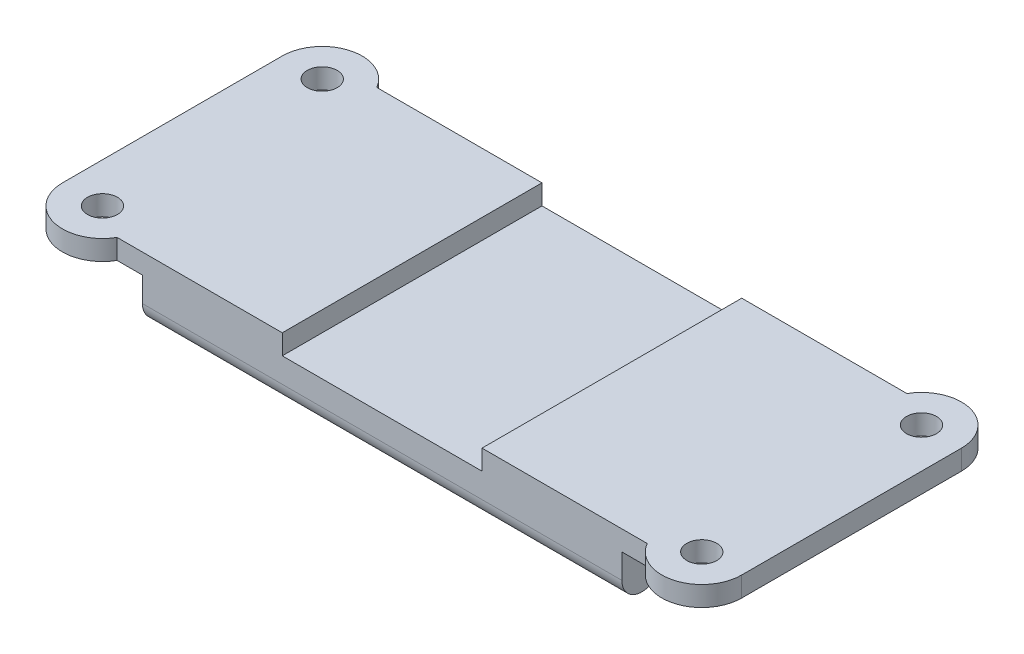
ISO-10303-21;
HEADER;
FILE_DESCRIPTION(('STEP AP214'),'2;1');
FILE_NAME('part.step','',(''),(''),'','','');
FILE_SCHEMA(('AUTOMOTIVE_DESIGN { 1 0 10303 214 1 1 1 1 }'));
ENDSEC;
DATA;
#1=APPLICATION_CONTEXT('core data for automotive mechanical design processes');
#2=APPLICATION_PROTOCOL_DEFINITION('international standard','automotive_design',2000,#1);
#3=PRODUCT_CONTEXT('',#1,'mechanical');
#4=PRODUCT('Part','Part','',(#3));
#5=PRODUCT_RELATED_PRODUCT_CATEGORY('part','',(#4));
#6=PRODUCT_DEFINITION_FORMATION('','',#4);
#7=PRODUCT_DEFINITION_CONTEXT('part definition',#1,'design');
#8=PRODUCT_DEFINITION('design','',#6,#7);
#9=PRODUCT_DEFINITION_SHAPE('','',#8);
#10=(LENGTH_UNIT() NAMED_UNIT(*) SI_UNIT(.MILLI.,.METRE.));
#11=(NAMED_UNIT(*) PLANE_ANGLE_UNIT() SI_UNIT($,.RADIAN.));
#12=(NAMED_UNIT(*) SI_UNIT($,.STERADIAN.) SOLID_ANGLE_UNIT());
#13=UNCERTAINTY_MEASURE_WITH_UNIT(LENGTH_MEASURE(1.E-05),#10,'distance_accuracy_value','');
#14=(GEOMETRIC_REPRESENTATION_CONTEXT(3) GLOBAL_UNCERTAINTY_ASSIGNED_CONTEXT((#13)) GLOBAL_UNIT_ASSIGNED_CONTEXT((#10,
#11,#12)) REPRESENTATION_CONTEXT('',''));
#15=CARTESIAN_POINT('',(0.,0.,0.));
#16=DIRECTION('',(0.,0.,1.));
#17=DIRECTION('',(1.,0.,0.));
#18=AXIS2_PLACEMENT_3D('',#15,#16,#17);
#19=CARTESIAN_POINT('',(24.,-8.,13.));
#20=DIRECTION('',(0.,0.,1.));
#21=DIRECTION('',(1.,0.,0.));
#22=AXIS2_PLACEMENT_3D('',#19,#20,#21);
#23=PLANE('',#22);
#24=DIRECTION('',(-1.,0.,0.));
#25=VECTOR('',#24,1.);
#26=CARTESIAN_POINT('',(34.,-2.,13.));
#27=LINE('',#26,#25);
#28=CARTESIAN_POINT('',(26.5358983848622,-2.,13.));
#29=VERTEX_POINT('',#28);
#30=CARTESIAN_POINT('',(24.,-2.,13.));
#31=VERTEX_POINT('',#30);
#32=EDGE_CURVE('E199',#29,#31,#27,.T.);
#33=ORIENTED_EDGE('',*,*,#32,.F.);
#34=DIRECTION('',(0.,1.,0.));
#35=VECTOR('',#34,1.);
#36=CARTESIAN_POINT('',(26.5358983848622,-2.,13.));
#37=LINE('',#36,#35);
#38=CARTESIAN_POINT('',(26.5358983848622,0.,13.));
#39=VERTEX_POINT('',#38);
#40=EDGE_CURVE('E186',#29,#39,#37,.T.);
#41=ORIENTED_EDGE('',*,*,#40,.T.);
#42=DIRECTION('',(1.,0.,0.));
#43=VECTOR('',#42,1.);
#44=CARTESIAN_POINT('',(24.,0.,13.));
#45=LINE('',#44,#43);
#46=CARTESIAN_POINT('',(10.,0.,13.));
#47=VERTEX_POINT('',#46);
#48=EDGE_CURVE('E197',#47,#39,#45,.T.);
#49=ORIENTED_EDGE('',*,*,#48,.F.);
#50=DIRECTION('',(0.,-1.,0.));
#51=VECTOR('',#50,1.);
#52=CARTESIAN_POINT('',(10.,0.,13.));
#53=LINE('',#52,#51);
#54=CARTESIAN_POINT('',(10.,-2.,13.));
#55=VERTEX_POINT('',#54);
#56=EDGE_CURVE('E410',#47,#55,#53,.T.);
#57=ORIENTED_EDGE('',*,*,#56,.T.);
#58=DIRECTION('',(1.,0.,0.));
#59=VECTOR('',#58,1.);
#60=CARTESIAN_POINT('',(0.,-2.,13.));
#61=LINE('',#60,#59);
#62=CARTESIAN_POINT('',(-10.,-2.,13.));
#63=VERTEX_POINT('',#62);
#64=EDGE_CURVE('E418',#63,#55,#61,.T.);
#65=ORIENTED_EDGE('',*,*,#64,.F.);
#66=DIRECTION('',(0.,-1.,0.));
#67=VECTOR('',#66,1.);
#68=CARTESIAN_POINT('',(-10.,0.,13.));
#69=LINE('',#68,#67);
#70=CARTESIAN_POINT('',(-10.,0.,13.));
#71=VERTEX_POINT('',#70);
#72=EDGE_CURVE('E405',#71,#63,#69,.T.);
#73=ORIENTED_EDGE('',*,*,#72,.F.);
#74=CARTESIAN_POINT('',(-26.5358983848622,0.,13.));
#75=VERTEX_POINT('',#74);
#76=EDGE_CURVE('E207',#75,#71,#45,.T.);
#77=ORIENTED_EDGE('',*,*,#76,.F.);
#78=DIRECTION('',(0.,1.,0.));
#79=VECTOR('',#78,1.);
#80=CARTESIAN_POINT('',(-26.5358983848622,-2.,13.));
#81=LINE('',#80,#79);
#82=CARTESIAN_POINT('',(-26.5358983848622,-2.,13.));
#83=VERTEX_POINT('',#82);
#84=EDGE_CURVE('E356',#83,#75,#81,.T.);
#85=ORIENTED_EDGE('',*,*,#84,.F.);
#86=DIRECTION('',(1.,0.,0.));
#87=VECTOR('',#86,1.);
#88=CARTESIAN_POINT('',(-34.,-2.,13.));
#89=LINE('',#88,#87);
#90=CARTESIAN_POINT('',(-24.,-2.,13.));
#91=VERTEX_POINT('',#90);
#92=EDGE_CURVE('E300',#83,#91,#89,.T.);
#93=ORIENTED_EDGE('',*,*,#92,.T.);
#94=DIRECTION('',(0.,1.,0.));
#95=VECTOR('',#94,1.);
#96=CARTESIAN_POINT('',(-24.,-8.,13.));
#97=LINE('',#96,#95);
#98=CARTESIAN_POINT('',(-24.,-4.46761924206189,13.));
#99=VERTEX_POINT('',#98);
#100=EDGE_CURVE('E218',#99,#91,#97,.T.);
#101=ORIENTED_EDGE('',*,*,#100,.F.);
#102=DIRECTION('',(1.,0.,0.));
#103=VECTOR('',#102,1.);
#104=CARTESIAN_POINT('',(24.,-4.46761924206188,13.));
#105=LINE('',#104,#103);
#106=CARTESIAN_POINT('',(24.,-4.46761924206188,13.));
#107=VERTEX_POINT('',#106);
#108=EDGE_CURVE('E257',#99,#107,#105,.T.);
#109=ORIENTED_EDGE('',*,*,#108,.T.);
#110=DIRECTION('',(0.,1.,0.));
#111=VECTOR('',#110,1.);
#112=CARTESIAN_POINT('',(24.,-8.,13.));
#113=LINE('',#112,#111);
#114=EDGE_CURVE('E226',#107,#31,#113,.T.);
#115=ORIENTED_EDGE('',*,*,#114,.T.);
#116=EDGE_LOOP('',(#33,#41,#49,#57,#65,#73,#77,#85,#93,#101,#109,#115));
#117=FACE_BOUND('',#116,.T.);
#118=ADVANCED_FACE('F35',(#117),#23,.T.);
#119=CARTESIAN_POINT('',(24.,-8.,-13.));
#120=DIRECTION('',(0.,0.,-1.));
#121=DIRECTION('',(-1.,0.,0.));
#122=AXIS2_PLACEMENT_3D('',#119,#120,#121);
#123=PLANE('',#122);
#124=DIRECTION('',(-1.,0.,0.));
#125=VECTOR('',#124,1.);
#126=CARTESIAN_POINT('',(24.,0.,-13.));
#127=LINE('',#126,#125);
#128=CARTESIAN_POINT('',(26.5358983848623,0.,-13.));
#129=VERTEX_POINT('',#128);
#130=CARTESIAN_POINT('',(10.,0.,-13.));
#131=VERTEX_POINT('',#130);
#132=EDGE_CURVE('E216',#129,#131,#127,.T.);
#133=ORIENTED_EDGE('',*,*,#132,.F.);
#134=DIRECTION('',(0.,1.,0.));
#135=VECTOR('',#134,1.);
#136=CARTESIAN_POINT('',(26.5358983848623,-2.,-13.));
#137=LINE('',#136,#135);
#138=CARTESIAN_POINT('',(26.5358983848622,-2.,-13.));
#139=VERTEX_POINT('',#138);
#140=EDGE_CURVE('E393',#129,#139,#137,.F.);
#141=ORIENTED_EDGE('',*,*,#140,.T.);
#142=DIRECTION('',(-1.,0.,0.));
#143=VECTOR('',#142,1.);
#144=CARTESIAN_POINT('',(34.,-2.,-13.));
#145=LINE('',#144,#143);
#146=CARTESIAN_POINT('',(24.,-2.,-13.));
#147=VERTEX_POINT('',#146);
#148=EDGE_CURVE('E383',#139,#147,#145,.T.);
#149=ORIENTED_EDGE('',*,*,#148,.T.);
#150=DIRECTION('',(0.,1.,0.));
#151=VECTOR('',#150,1.);
#152=CARTESIAN_POINT('',(24.,-8.,-13.));
#153=LINE('',#152,#151);
#154=CARTESIAN_POINT('',(24.,-4.46761924206188,-13.));
#155=VERTEX_POINT('',#154);
#156=EDGE_CURVE('E223',#155,#147,#153,.T.);
#157=ORIENTED_EDGE('',*,*,#156,.F.);
#158=DIRECTION('',(-1.,0.,0.));
#159=VECTOR('',#158,1.);
#160=CARTESIAN_POINT('',(-24.,-4.46761924206188,-13.));
#161=LINE('',#160,#159);
#162=CARTESIAN_POINT('',(-24.,-4.46761924206188,-13.));
#163=VERTEX_POINT('',#162);
#164=EDGE_CURVE('E246',#155,#163,#161,.T.);
#165=ORIENTED_EDGE('',*,*,#164,.T.);
#166=DIRECTION('',(0.,1.,0.));
#167=VECTOR('',#166,1.);
#168=CARTESIAN_POINT('',(-24.,-8.,-13.));
#169=LINE('',#168,#167);
#170=CARTESIAN_POINT('',(-24.,-2.,-13.));
#171=VERTEX_POINT('',#170);
#172=EDGE_CURVE('E219',#163,#171,#169,.T.);
#173=ORIENTED_EDGE('',*,*,#172,.T.);
#174=DIRECTION('',(1.,0.,0.));
#175=VECTOR('',#174,1.);
#176=CARTESIAN_POINT('',(-34.,-2.,-13.));
#177=LINE('',#176,#175);
#178=CARTESIAN_POINT('',(-26.5358983848622,-2.,-13.));
#179=VERTEX_POINT('',#178);
#180=EDGE_CURVE('E302',#179,#171,#177,.T.);
#181=ORIENTED_EDGE('',*,*,#180,.F.);
#182=DIRECTION('',(0.,1.,0.));
#183=VECTOR('',#182,1.);
#184=CARTESIAN_POINT('',(-26.5358983848622,-2.,-13.));
#185=LINE('',#184,#183);
#186=CARTESIAN_POINT('',(-26.5358983848622,0.,-13.));
#187=VERTEX_POINT('',#186);
#188=EDGE_CURVE('E402',#179,#187,#185,.T.);
#189=ORIENTED_EDGE('',*,*,#188,.T.);
#190=CARTESIAN_POINT('',(-10.,0.,-13.));
#191=VERTEX_POINT('',#190);
#192=EDGE_CURVE('E210',#191,#187,#127,.T.);
#193=ORIENTED_EDGE('',*,*,#192,.F.);
#194=DIRECTION('',(0.,-1.,0.));
#195=VECTOR('',#194,1.);
#196=CARTESIAN_POINT('',(-10.,0.,-13.));
#197=LINE('',#196,#195);
#198=CARTESIAN_POINT('',(-10.,-2.,-13.));
#199=VERTEX_POINT('',#198);
#200=EDGE_CURVE('E406',#191,#199,#197,.T.);
#201=ORIENTED_EDGE('',*,*,#200,.T.);
#202=DIRECTION('',(1.,0.,0.));
#203=VECTOR('',#202,1.);
#204=CARTESIAN_POINT('',(0.,-2.,-13.));
#205=LINE('',#204,#203);
#206=CARTESIAN_POINT('',(10.,-2.,-13.));
#207=VERTEX_POINT('',#206);
#208=EDGE_CURVE('E409',#199,#207,#205,.T.);
#209=ORIENTED_EDGE('',*,*,#208,.T.);
#210=DIRECTION('',(0.,-1.,0.));
#211=VECTOR('',#210,1.);
#212=CARTESIAN_POINT('',(10.,0.,-13.));
#213=LINE('',#212,#211);
#214=EDGE_CURVE('E413',#131,#207,#213,.T.);
#215=ORIENTED_EDGE('',*,*,#214,.F.);
#216=EDGE_LOOP('',(#133,#141,#149,#157,#165,#173,#181,#189,#193,#201,#209,#215));
#217=FACE_BOUND('',#216,.T.);
#218=ADVANCED_FACE('F366',(#217),#123,.T.);
#219=CARTESIAN_POINT('',(0.,0.,0.));
#220=DIRECTION('',(0.,1.,0.));
#221=DIRECTION('',(0.,0.,1.));
#222=AXIS2_PLACEMENT_3D('',#219,#220,#221);
#223=PLANE('',#222);
#224=CARTESIAN_POINT('',(30.,0.,11.));
#225=DIRECTION('',(0.,1.,0.));
#226=DIRECTION('',(0.,0.,1.));
#227=AXIS2_PLACEMENT_3D('',#224,#225,#226);
#228=CIRCLE('',#227,4.);
#229=CARTESIAN_POINT('',(34.,0.,11.));
#230=VERTEX_POINT('',#229);
#231=EDGE_CURVE('E58',#230,#39,#228,.F.);
#232=ORIENTED_EDGE('',*,*,#231,.F.);
#233=DIRECTION('',(0.,0.,-1.));
#234=VECTOR('',#233,1.);
#235=CARTESIAN_POINT('',(34.,0.,0.));
#236=LINE('',#235,#234);
#237=CARTESIAN_POINT('',(34.,0.,-11.));
#238=VERTEX_POINT('',#237);
#239=EDGE_CURVE('E377',#230,#238,#236,.T.);
#240=ORIENTED_EDGE('',*,*,#239,.T.);
#241=CARTESIAN_POINT('',(30.,0.,-11.));
#242=DIRECTION('',(0.,1.,0.));
#243=DIRECTION('',(0.,0.,1.));
#244=AXIS2_PLACEMENT_3D('',#241,#242,#243);
#245=CIRCLE('',#244,4.);
#246=EDGE_CURVE('E200',#129,#238,#245,.F.);
#247=ORIENTED_EDGE('',*,*,#246,.F.);
#248=ORIENTED_EDGE('',*,*,#132,.T.);
#249=DIRECTION('',(0.,0.,1.));
#250=VECTOR('',#249,1.);
#251=CARTESIAN_POINT('',(10.,0.,-13.));
#252=LINE('',#251,#250);
#253=EDGE_CURVE('E206',#131,#47,#252,.T.);
#254=ORIENTED_EDGE('',*,*,#253,.T.);
#255=ORIENTED_EDGE('',*,*,#48,.T.);
#256=EDGE_LOOP('',(#232,#240,#247,#248,#254,#255));
#257=FACE_BOUND('',#256,.T.);
#258=CARTESIAN_POINT('',(30.,0.,11.));
#259=DIRECTION('',(0.,1.,0.));
#260=DIRECTION('',(0.,0.,1.));
#261=AXIS2_PLACEMENT_3D('',#258,#259,#260);
#262=CIRCLE('',#261,1.5);
#263=CARTESIAN_POINT('',(30.,0.,12.5));
#264=VERTEX_POINT('',#263);
#265=EDGE_CURVE('E423',#264,#264,#262,.T.);
#266=ORIENTED_EDGE('',*,*,#265,.F.);
#267=EDGE_LOOP('',(#266));
#268=FACE_BOUND('',#267,.T.);
#269=CARTESIAN_POINT('',(30.,0.,-11.));
#270=DIRECTION('',(0.,1.,0.));
#271=DIRECTION('',(0.,0.,1.));
#272=AXIS2_PLACEMENT_3D('',#269,#270,#271);
#273=CIRCLE('',#272,1.5);
#274=CARTESIAN_POINT('',(30.,0.,-9.49999999999999));
#275=VERTEX_POINT('',#274);
#276=EDGE_CURVE('E432',#275,#275,#273,.F.);
#277=ORIENTED_EDGE('',*,*,#276,.T.);
#278=EDGE_LOOP('',(#277));
#279=FACE_BOUND('',#278,.T.);
#280=ADVANCED_FACE('F203',(#257,#268,#279),#223,.T.);
#281=CARTESIAN_POINT('',(-30.,0.,11.));
#282=DIRECTION('',(0.,1.,0.));
#283=DIRECTION('',(0.,0.,1.));
#284=AXIS2_PLACEMENT_3D('',#281,#282,#283);
#285=CIRCLE('',#284,4.);
#286=CARTESIAN_POINT('',(-34.,0.,11.));
#287=VERTEX_POINT('',#286);
#288=EDGE_CURVE('E298',#287,#75,#285,.T.);
#289=ORIENTED_EDGE('',*,*,#288,.T.);
#290=ORIENTED_EDGE('',*,*,#76,.T.);
#291=DIRECTION('',(0.,0.,1.));
#292=VECTOR('',#291,1.);
#293=CARTESIAN_POINT('',(-10.,0.,-13.));
#294=LINE('',#293,#292);
#295=EDGE_CURVE('E415',#191,#71,#294,.T.);
#296=ORIENTED_EDGE('',*,*,#295,.F.);
#297=ORIENTED_EDGE('',*,*,#192,.T.);
#298=CARTESIAN_POINT('',(-30.,0.,-11.));
#299=DIRECTION('',(0.,1.,0.));
#300=DIRECTION('',(0.,0.,1.));
#301=AXIS2_PLACEMENT_3D('',#298,#299,#300);
#302=CIRCLE('',#301,4.);
#303=CARTESIAN_POINT('',(-34.,0.,-11.));
#304=VERTEX_POINT('',#303);
#305=EDGE_CURVE('E50',#187,#304,#302,.T.);
#306=ORIENTED_EDGE('',*,*,#305,.T.);
#307=DIRECTION('',(0.,0.,-1.));
#308=VECTOR('',#307,1.);
#309=CARTESIAN_POINT('',(-34.,0.,0.));
#310=LINE('',#309,#308);
#311=EDGE_CURVE('E290',#287,#304,#310,.T.);
#312=ORIENTED_EDGE('',*,*,#311,.F.);
#313=EDGE_LOOP('',(#289,#290,#296,#297,#306,#312));
#314=FACE_BOUND('',#313,.T.);
#315=CARTESIAN_POINT('',(-30.,0.,-11.));
#316=DIRECTION('',(0.,1.,0.));
#317=DIRECTION('',(0.,0.,1.));
#318=AXIS2_PLACEMENT_3D('',#315,#316,#317);
#319=CIRCLE('',#318,1.5);
#320=CARTESIAN_POINT('',(-30.,0.,-9.49999999999999));
#321=VERTEX_POINT('',#320);
#322=EDGE_CURVE('E273',#321,#321,#319,.T.);
#323=ORIENTED_EDGE('',*,*,#322,.F.);
#324=EDGE_LOOP('',(#323));
#325=FACE_BOUND('',#324,.T.);
#326=CARTESIAN_POINT('',(-30.,0.,11.));
#327=DIRECTION('',(0.,1.,0.));
#328=DIRECTION('',(0.,0.,1.));
#329=AXIS2_PLACEMENT_3D('',#326,#327,#328);
#330=CIRCLE('',#329,1.5);
#331=CARTESIAN_POINT('',(-30.,0.,12.5));
#332=VERTEX_POINT('',#331);
#333=EDGE_CURVE('E433',#332,#332,#330,.F.);
#334=ORIENTED_EDGE('',*,*,#333,.T.);
#335=EDGE_LOOP('',(#334));
#336=FACE_BOUND('',#335,.T.);
#337=ADVANCED_FACE('F296',(#314,#325,#336),#223,.T.);
#338=CARTESIAN_POINT('',(-34.,-2.,0.));
#339=DIRECTION('',(0.,1.,0.));
#340=DIRECTION('',(0.,0.,1.));
#341=AXIS2_PLACEMENT_3D('',#338,#339,#340);
#342=PLANE('',#341);
#343=ORIENTED_EDGE('',*,*,#92,.F.);
#344=CARTESIAN_POINT('',(-30.,-2.,11.));
#345=DIRECTION('',(0.,1.,0.));
#346=DIRECTION('',(0.,0.,1.));
#347=AXIS2_PLACEMENT_3D('',#344,#345,#346);
#348=CIRCLE('',#347,4.);
#349=CARTESIAN_POINT('',(-34.,-2.,11.));
#350=VERTEX_POINT('',#349);
#351=EDGE_CURVE('E360',#350,#83,#348,.T.);
#352=ORIENTED_EDGE('',*,*,#351,.F.);
#353=DIRECTION('',(0.,0.,1.));
#354=VECTOR('',#353,1.);
#355=CARTESIAN_POINT('',(-34.,-2.,0.));
#356=LINE('',#355,#354);
#357=CARTESIAN_POINT('',(-34.,-2.,-11.));
#358=VERTEX_POINT('',#357);
#359=EDGE_CURVE('E292',#358,#350,#356,.T.);
#360=ORIENTED_EDGE('',*,*,#359,.F.);
#361=CARTESIAN_POINT('',(-30.,-2.,-11.));
#362=DIRECTION('',(0.,1.,0.));
#363=DIRECTION('',(0.,0.,1.));
#364=AXIS2_PLACEMENT_3D('',#361,#362,#363);
#365=CIRCLE('',#364,4.);
#366=EDGE_CURVE('E400',#179,#358,#365,.T.);
#367=ORIENTED_EDGE('',*,*,#366,.F.);
#368=ORIENTED_EDGE('',*,*,#180,.T.);
#369=DIRECTION('',(0.,0.,1.));
#370=VECTOR('',#369,1.);
#371=CARTESIAN_POINT('',(-24.,-2.,0.));
#372=LINE('',#371,#370);
#373=EDGE_CURVE('E304',#171,#91,#372,.T.);
#374=ORIENTED_EDGE('',*,*,#373,.T.);
#375=EDGE_LOOP('',(#343,#352,#360,#367,#368,#374));
#376=FACE_BOUND('',#375,.T.);
#377=CARTESIAN_POINT('',(-30.,-2.,-11.));
#378=DIRECTION('',(0.,1.,0.));
#379=DIRECTION('',(0.,0.,1.));
#380=AXIS2_PLACEMENT_3D('',#377,#378,#379);
#381=CIRCLE('',#380,1.5);
#382=CARTESIAN_POINT('',(-30.,-2.,-9.49999999999999));
#383=VERTEX_POINT('',#382);
#384=EDGE_CURVE('E276',#383,#383,#381,.T.);
#385=ORIENTED_EDGE('',*,*,#384,.T.);
#386=EDGE_LOOP('',(#385));
#387=FACE_BOUND('',#386,.T.);
#388=CARTESIAN_POINT('',(-30.,-2.,11.));
#389=DIRECTION('',(0.,1.,0.));
#390=DIRECTION('',(0.,0.,1.));
#391=AXIS2_PLACEMENT_3D('',#388,#389,#390);
#392=CIRCLE('',#391,1.5);
#393=CARTESIAN_POINT('',(-30.,-2.,12.5));
#394=VERTEX_POINT('',#393);
#395=EDGE_CURVE('E279',#394,#394,#392,.F.);
#396=ORIENTED_EDGE('',*,*,#395,.F.);
#397=EDGE_LOOP('',(#396));
#398=FACE_BOUND('',#397,.T.);
#399=ADVANCED_FACE('F358',(#376,#387,#398),#342,.F.);
#400=CARTESIAN_POINT('',(34.,-2.,0.));
#401=DIRECTION('',(0.,-1.,0.));
#402=DIRECTION('',(0.,0.,-1.));
#403=AXIS2_PLACEMENT_3D('',#400,#401,#402);
#404=PLANE('',#403);
#405=CARTESIAN_POINT('',(30.,-2.,11.));
#406=DIRECTION('',(0.,1.,0.));
#407=DIRECTION('',(0.,0.,1.));
#408=AXIS2_PLACEMENT_3D('',#405,#406,#407);
#409=CIRCLE('',#408,4.);
#410=CARTESIAN_POINT('',(34.,-2.,11.));
#411=VERTEX_POINT('',#410);
#412=EDGE_CURVE('E191',#411,#29,#409,.F.);
#413=ORIENTED_EDGE('',*,*,#412,.T.);
#414=ORIENTED_EDGE('',*,*,#32,.T.);
#415=DIRECTION('',(0.,0.,1.));
#416=VECTOR('',#415,1.);
#417=CARTESIAN_POINT('',(24.,-2.,0.));
#418=LINE('',#417,#416);
#419=EDGE_CURVE('E282',#147,#31,#418,.T.);
#420=ORIENTED_EDGE('',*,*,#419,.F.);
#421=ORIENTED_EDGE('',*,*,#148,.F.);
#422=CARTESIAN_POINT('',(30.,-2.,-11.));
#423=DIRECTION('',(0.,1.,0.));
#424=DIRECTION('',(0.,0.,1.));
#425=AXIS2_PLACEMENT_3D('',#422,#423,#424);
#426=CIRCLE('',#425,4.);
#427=CARTESIAN_POINT('',(34.,-2.,-11.));
#428=VERTEX_POINT('',#427);
#429=EDGE_CURVE('E391',#139,#428,#426,.F.);
#430=ORIENTED_EDGE('',*,*,#429,.T.);
#431=DIRECTION('',(0.,0.,1.));
#432=VECTOR('',#431,1.);
#433=CARTESIAN_POINT('',(34.,-2.,0.));
#434=LINE('',#433,#432);
#435=EDGE_CURVE('E379',#428,#411,#434,.T.);
#436=ORIENTED_EDGE('',*,*,#435,.T.);
#437=EDGE_LOOP('',(#413,#414,#420,#421,#430,#436));
#438=FACE_BOUND('',#437,.T.);
#439=CARTESIAN_POINT('',(30.,-2.,11.));
#440=DIRECTION('',(0.,-1.,0.));
#441=DIRECTION('',(0.,0.,-1.));
#442=AXIS2_PLACEMENT_3D('',#439,#440,#441);
#443=CIRCLE('',#442,1.5);
#444=CARTESIAN_POINT('',(30.,-2.,9.5));
#445=VERTEX_POINT('',#444);
#446=EDGE_CURVE('E269',#445,#445,#443,.T.);
#447=ORIENTED_EDGE('',*,*,#446,.F.);
#448=EDGE_LOOP('',(#447));
#449=FACE_BOUND('',#448,.T.);
#450=CARTESIAN_POINT('',(30.,-2.,-11.));
#451=DIRECTION('',(0.,-1.,0.));
#452=DIRECTION('',(0.,0.,-1.));
#453=AXIS2_PLACEMENT_3D('',#450,#451,#452);
#454=CIRCLE('',#453,1.5);
#455=CARTESIAN_POINT('',(30.,-2.,-12.5));
#456=VERTEX_POINT('',#455);
#457=EDGE_CURVE('E272',#456,#456,#454,.F.);
#458=ORIENTED_EDGE('',*,*,#457,.T.);
#459=EDGE_LOOP('',(#458));
#460=FACE_BOUND('',#459,.T.);
#461=ADVANCED_FACE('F384',(#438,#449,#460),#404,.T.);
#462=CARTESIAN_POINT('',(24.,-8.,13.));
#463=DIRECTION('',(1.,0.,0.));
#464=DIRECTION('',(0.,0.,-1.));
#465=AXIS2_PLACEMENT_3D('',#462,#463,#464);
#466=PLANE('',#465);
#467=ORIENTED_EDGE('',*,*,#156,.T.);
#468=ORIENTED_EDGE('',*,*,#419,.T.);
#469=ORIENTED_EDGE('',*,*,#114,.F.);
#470=CARTESIAN_POINT('',(24.,-4.46761924206188,11.));
#471=DIRECTION('',(1.,0.,0.));
#472=DIRECTION('',(0.,0.,-1.));
#473=AXIS2_PLACEMENT_3D('',#470,#471,#472);
#474=CIRCLE('',#473,2.);
#475=CARTESIAN_POINT('',(24.,-6.18260509348697,9.97100848914495));
#476=VERTEX_POINT('',#475);
#477=EDGE_CURVE('E253',#107,#476,#474,.T.);
#478=ORIENTED_EDGE('',*,*,#477,.T.);
#479=DIRECTION('',(0.,0.514495755427527,-0.857492925712544));
#480=VECTOR('',#479,1.);
#481=CARTESIAN_POINT('',(24.,-8.,13.));
#482=LINE('',#481,#480);
#483=CARTESIAN_POINT('',(24.,-5.28501414857491,8.47502358095818));
#484=VERTEX_POINT('',#483);
#485=EDGE_CURVE('E208',#476,#484,#482,.T.);
#486=ORIENTED_EDGE('',*,*,#485,.T.);
#487=CARTESIAN_POINT('',(24.,-7.,7.44603207010313));
#488=DIRECTION('',(1.,0.,0.));
#489=DIRECTION('',(0.,0.,-1.));
#490=AXIS2_PLACEMENT_3D('',#487,#488,#489);
#491=CIRCLE('',#490,2.);
#492=CARTESIAN_POINT('',(24.,-5.,7.44603207010313));
#493=VERTEX_POINT('',#492);
#494=EDGE_CURVE('E260',#484,#493,#491,.F.);
#495=ORIENTED_EDGE('',*,*,#494,.T.);
#496=DIRECTION('',(0.,0.,-1.));
#497=VECTOR('',#496,1.);
#498=CARTESIAN_POINT('',(24.,-5.,13.));
#499=LINE('',#498,#497);
#500=CARTESIAN_POINT('',(24.,-5.,-7.44603207010313));
#501=VERTEX_POINT('',#500);
#502=EDGE_CURVE('E222',#493,#501,#499,.T.);
#503=ORIENTED_EDGE('',*,*,#502,.T.);
#504=CARTESIAN_POINT('',(24.,-7.,-7.44603207010313));
#505=DIRECTION('',(1.,0.,0.));
#506=DIRECTION('',(0.,0.,-1.));
#507=AXIS2_PLACEMENT_3D('',#504,#505,#506);
#508=CIRCLE('',#507,2.);
#509=CARTESIAN_POINT('',(24.,-5.28501414857491,-8.47502358095819));
#510=VERTEX_POINT('',#509);
#511=EDGE_CURVE('E264',#501,#510,#508,.F.);
#512=ORIENTED_EDGE('',*,*,#511,.T.);
#513=DIRECTION('',(0.,0.514495755427527,0.857492925712544));
#514=VECTOR('',#513,1.);
#515=CARTESIAN_POINT('',(24.,3.47058823529412,6.11764705882353));
#516=LINE('',#515,#514);
#517=CARTESIAN_POINT('',(24.,-6.18260509348697,-9.97100848914495));
#518=VERTEX_POINT('',#517);
#519=EDGE_CURVE('E212',#518,#510,#516,.T.);
#520=ORIENTED_EDGE('',*,*,#519,.F.);
#521=CARTESIAN_POINT('',(24.,-4.46761924206188,-11.));
#522=DIRECTION('',(1.,0.,0.));
#523=DIRECTION('',(0.,0.,-1.));
#524=AXIS2_PLACEMENT_3D('',#521,#522,#523);
#525=CIRCLE('',#524,2.);
#526=EDGE_CURVE('E255',#518,#155,#525,.T.);
#527=ORIENTED_EDGE('',*,*,#526,.T.);
#528=EDGE_LOOP('',(#467,#468,#469,#478,#486,#495,#503,#512,#520,#527));
#529=FACE_BOUND('',#528,.T.);
#530=ADVANCED_FACE('F372',(#529),#466,.T.);
#531=CARTESIAN_POINT('',(-24.,-8.,13.));
#532=DIRECTION('',(-1.,0.,0.));
#533=DIRECTION('',(0.,0.,1.));
#534=AXIS2_PLACEMENT_3D('',#531,#532,#533);
#535=PLANE('',#534);
#536=ORIENTED_EDGE('',*,*,#373,.F.);
#537=ORIENTED_EDGE('',*,*,#172,.F.);
#538=CARTESIAN_POINT('',(-24.,-4.46761924206188,-11.));
#539=DIRECTION('',(-1.,0.,0.));
#540=DIRECTION('',(0.,0.,1.));
#541=AXIS2_PLACEMENT_3D('',#538,#539,#540);
#542=CIRCLE('',#541,2.);
#543=CARTESIAN_POINT('',(-24.,-6.18260509348697,-9.97100848914494));
#544=VERTEX_POINT('',#543);
#545=EDGE_CURVE('E251',#163,#544,#542,.T.);
#546=ORIENTED_EDGE('',*,*,#545,.T.);
#547=DIRECTION('',(0.,0.514495755427527,0.857492925712544));
#548=VECTOR('',#547,1.);
#549=CARTESIAN_POINT('',(-24.,-0.14705882352941,0.0882352941176463));
#550=LINE('',#549,#548);
#551=CARTESIAN_POINT('',(-24.,-5.28501414857491,-8.47502358095818));
#552=VERTEX_POINT('',#551);
#553=EDGE_CURVE('E311',#544,#552,#550,.T.);
#554=ORIENTED_EDGE('',*,*,#553,.T.);
#555=CARTESIAN_POINT('',(-24.,-7.,-7.44603207010313));
#556=DIRECTION('',(-1.,0.,0.));
#557=DIRECTION('',(0.,0.,1.));
#558=AXIS2_PLACEMENT_3D('',#555,#556,#557);
#559=CIRCLE('',#558,2.);
#560=CARTESIAN_POINT('',(-24.,-5.,-7.44603207010313));
#561=VERTEX_POINT('',#560);
#562=EDGE_CURVE('E266',#552,#561,#559,.F.);
#563=ORIENTED_EDGE('',*,*,#562,.T.);
#564=DIRECTION('',(0.,0.,-1.));
#565=VECTOR('',#564,1.);
#566=CARTESIAN_POINT('',(-24.,-5.,0.));
#567=LINE('',#566,#565);
#568=CARTESIAN_POINT('',(-24.,-5.,7.44603207010313));
#569=VERTEX_POINT('',#568);
#570=EDGE_CURVE('E314',#569,#561,#567,.T.);
#571=ORIENTED_EDGE('',*,*,#570,.F.);
#572=CARTESIAN_POINT('',(-24.,-7.,7.44603207010313));
#573=DIRECTION('',(-1.,0.,0.));
#574=DIRECTION('',(0.,0.,1.));
#575=AXIS2_PLACEMENT_3D('',#572,#573,#574);
#576=CIRCLE('',#575,2.);
#577=CARTESIAN_POINT('',(-24.,-5.28501414857491,8.47502358095818));
#578=VERTEX_POINT('',#577);
#579=EDGE_CURVE('E262',#569,#578,#576,.F.);
#580=ORIENTED_EDGE('',*,*,#579,.T.);
#581=DIRECTION('',(0.,0.514495755427526,-0.857492925712544));
#582=VECTOR('',#581,1.);
#583=CARTESIAN_POINT('',(-24.,-0.147058823529413,-0.0882352941176476));
#584=LINE('',#583,#582);
#585=CARTESIAN_POINT('',(-24.,-6.18260509348697,9.97100848914495));
#586=VERTEX_POINT('',#585);
#587=EDGE_CURVE('E317',#586,#578,#584,.T.);
#588=ORIENTED_EDGE('',*,*,#587,.F.);
#589=CARTESIAN_POINT('',(-24.,-4.46761924206189,11.));
#590=DIRECTION('',(-1.,0.,0.));
#591=DIRECTION('',(0.,0.,1.));
#592=AXIS2_PLACEMENT_3D('',#589,#590,#591);
#593=CIRCLE('',#592,2.);
#594=EDGE_CURVE('E249',#586,#99,#593,.T.);
#595=ORIENTED_EDGE('',*,*,#594,.T.);
#596=ORIENTED_EDGE('',*,*,#100,.T.);
#597=EDGE_LOOP('',(#536,#537,#546,#554,#563,#571,#580,#588,#595,#596));
#598=FACE_BOUND('',#597,.T.);
#599=ADVANCED_FACE('F335',(#598),#535,.T.);
#600=CARTESIAN_POINT('',(-24.,-0.147058823529413,-0.0882352941176476));
#601=DIRECTION('',(0.,-0.857492925712544,-0.514495755427527));
#602=DIRECTION('',(0.,0.514495755427527,-0.857492925712544));
#603=AXIS2_PLACEMENT_3D('',#600,#601,#602);
#604=PLANE('',#603);
#605=ORIENTED_EDGE('',*,*,#587,.T.);
#606=DIRECTION('',(1.,0.,0.));
#607=VECTOR('',#606,1.);
#608=CARTESIAN_POINT('',(24.,-5.28501414857491,8.47502358095818));
#609=LINE('',#608,#607);
#610=EDGE_CURVE('E234',#578,#484,#609,.T.);
#611=ORIENTED_EDGE('',*,*,#610,.T.);
#612=ORIENTED_EDGE('',*,*,#485,.F.);
#613=DIRECTION('',(1.,0.,0.));
#614=VECTOR('',#613,1.);
#615=CARTESIAN_POINT('',(-24.,-6.18260509348697,9.97100848914495));
#616=LINE('',#615,#614);
#617=EDGE_CURVE('E232',#476,#586,#616,.F.);
#618=ORIENTED_EDGE('',*,*,#617,.T.);
#619=EDGE_LOOP('',(#605,#611,#612,#618));
#620=FACE_BOUND('',#619,.T.);
#621=ADVANCED_FACE('F347',(#620),#604,.T.);
#622=CARTESIAN_POINT('',(-24.,-5.,0.));
#623=DIRECTION('',(0.,-1.,0.));
#624=DIRECTION('',(0.,0.,-1.));
#625=AXIS2_PLACEMENT_3D('',#622,#623,#624);
#626=PLANE('',#625);
#627=ORIENTED_EDGE('',*,*,#502,.F.);
#628=DIRECTION('',(1.,0.,0.));
#629=VECTOR('',#628,1.);
#630=CARTESIAN_POINT('',(-24.,-5.,7.44603207010313));
#631=LINE('',#630,#629);
#632=EDGE_CURVE('E240',#493,#569,#631,.F.);
#633=ORIENTED_EDGE('',*,*,#632,.T.);
#634=ORIENTED_EDGE('',*,*,#570,.T.);
#635=DIRECTION('',(1.,0.,0.));
#636=VECTOR('',#635,1.);
#637=CARTESIAN_POINT('',(-24.,-5.,-7.44603207010313));
#638=LINE('',#637,#636);
#639=EDGE_CURVE('E237',#561,#501,#638,.T.);
#640=ORIENTED_EDGE('',*,*,#639,.T.);
#641=EDGE_LOOP('',(#627,#633,#634,#640));
#642=FACE_BOUND('',#641,.T.);
#643=ADVANCED_FACE('F339',(#642),#626,.T.);
#644=CARTESIAN_POINT('',(-24.,-0.14705882352941,0.0882352941176463));
#645=DIRECTION('',(0.,0.857492925712544,-0.514495755427527));
#646=DIRECTION('',(0.,0.514495755427527,0.857492925712544));
#647=AXIS2_PLACEMENT_3D('',#644,#645,#646);
#648=PLANE('',#647);
#649=ORIENTED_EDGE('',*,*,#519,.T.);
#650=DIRECTION('',(1.,0.,0.));
#651=VECTOR('',#650,1.);
#652=CARTESIAN_POINT('',(-24.,-5.28501414857491,-8.47502358095818));
#653=LINE('',#652,#651);
#654=EDGE_CURVE('E244',#510,#552,#653,.F.);
#655=ORIENTED_EDGE('',*,*,#654,.T.);
#656=ORIENTED_EDGE('',*,*,#553,.F.);
#657=DIRECTION('',(-1.,0.,0.));
#658=VECTOR('',#657,1.);
#659=CARTESIAN_POINT('',(24.,-6.18260509348697,-9.97100848914495));
#660=LINE('',#659,#658);
#661=EDGE_CURVE('E242',#544,#518,#660,.F.);
#662=ORIENTED_EDGE('',*,*,#661,.T.);
#663=EDGE_LOOP('',(#649,#655,#656,#662));
#664=FACE_BOUND('',#663,.T.);
#665=ADVANCED_FACE('F323',(#664),#648,.F.);
#666=CARTESIAN_POINT('',(-24.,-7.,7.44603207010313));
#667=DIRECTION('',(-1.,0.,0.));
#668=DIRECTION('',(0.,0.,1.));
#669=AXIS2_PLACEMENT_3D('',#666,#667,#668);
#670=CYLINDRICAL_SURFACE('',#669,2.);
#671=ORIENTED_EDGE('',*,*,#579,.F.);
#672=ORIENTED_EDGE('',*,*,#632,.F.);
#673=ORIENTED_EDGE('',*,*,#494,.F.);
#674=ORIENTED_EDGE('',*,*,#610,.F.);
#675=EDGE_LOOP('',(#671,#672,#673,#674));
#676=FACE_BOUND('',#675,.T.);
#677=ADVANCED_FACE('F342',(#676),#670,.F.);
#678=CARTESIAN_POINT('',(-24.,-7.,-7.44603207010313));
#679=DIRECTION('',(1.,0.,0.));
#680=DIRECTION('',(0.,0.,-1.));
#681=AXIS2_PLACEMENT_3D('',#678,#679,#680);
#682=CYLINDRICAL_SURFACE('',#681,2.);
#683=ORIENTED_EDGE('',*,*,#562,.F.);
#684=ORIENTED_EDGE('',*,*,#654,.F.);
#685=ORIENTED_EDGE('',*,*,#511,.F.);
#686=ORIENTED_EDGE('',*,*,#639,.F.);
#687=EDGE_LOOP('',(#683,#684,#685,#686));
#688=FACE_BOUND('',#687,.T.);
#689=ADVANCED_FACE('F330',(#688),#682,.F.);
#690=CARTESIAN_POINT('',(24.,-4.46761924206188,-11.));
#691=DIRECTION('',(1.,0.,0.));
#692=DIRECTION('',(0.,0.,-1.));
#693=AXIS2_PLACEMENT_3D('',#690,#691,#692);
#694=CYLINDRICAL_SURFACE('',#693,2.);
#695=ORIENTED_EDGE('',*,*,#526,.F.);
#696=ORIENTED_EDGE('',*,*,#661,.F.);
#697=ORIENTED_EDGE('',*,*,#545,.F.);
#698=ORIENTED_EDGE('',*,*,#164,.F.);
#699=EDGE_LOOP('',(#695,#696,#697,#698));
#700=FACE_BOUND('',#699,.T.);
#701=ADVANCED_FACE('F371',(#700),#694,.T.);
#702=CARTESIAN_POINT('',(24.,-4.46761924206188,11.));
#703=DIRECTION('',(1.,0.,0.));
#704=DIRECTION('',(0.,0.,-1.));
#705=AXIS2_PLACEMENT_3D('',#702,#703,#704);
#706=CYLINDRICAL_SURFACE('',#705,2.);
#707=ORIENTED_EDGE('',*,*,#594,.F.);
#708=ORIENTED_EDGE('',*,*,#617,.F.);
#709=ORIENTED_EDGE('',*,*,#477,.F.);
#710=ORIENTED_EDGE('',*,*,#108,.F.);
#711=EDGE_LOOP('',(#707,#708,#709,#710));
#712=FACE_BOUND('',#711,.T.);
#713=ADVANCED_FACE('F37',(#712),#706,.T.);
#714=CARTESIAN_POINT('',(-34.,0.,0.));
#715=DIRECTION('',(-1.,0.,0.));
#716=DIRECTION('',(0.,0.,1.));
#717=AXIS2_PLACEMENT_3D('',#714,#715,#716);
#718=PLANE('',#717);
#719=ORIENTED_EDGE('',*,*,#311,.T.);
#720=DIRECTION('',(0.,-1.,0.));
#721=VECTOR('',#720,1.);
#722=CARTESIAN_POINT('',(-34.,0.,-11.));
#723=LINE('',#722,#721);
#724=EDGE_CURVE('E11',#304,#358,#723,.T.);
#725=ORIENTED_EDGE('',*,*,#724,.T.);
#726=ORIENTED_EDGE('',*,*,#359,.T.);
#727=DIRECTION('',(0.,1.,0.));
#728=VECTOR('',#727,1.);
#729=CARTESIAN_POINT('',(-34.,0.,11.));
#730=LINE('',#729,#728);
#731=EDGE_CURVE('E43',#350,#287,#730,.T.);
#732=ORIENTED_EDGE('',*,*,#731,.T.);
#733=EDGE_LOOP('',(#719,#725,#726,#732));
#734=FACE_BOUND('',#733,.T.);
#735=ADVANCED_FACE('F289',(#734),#718,.T.);
#736=CARTESIAN_POINT('',(34.,0.,0.));
#737=DIRECTION('',(1.,0.,0.));
#738=DIRECTION('',(0.,0.,1.));
#739=AXIS2_PLACEMENT_3D('',#736,#737,#738);
#740=PLANE('',#739);
#741=ORIENTED_EDGE('',*,*,#239,.F.);
#742=DIRECTION('',(0.,1.,0.));
#743=VECTOR('',#742,1.);
#744=CARTESIAN_POINT('',(34.,0.,11.));
#745=LINE('',#744,#743);
#746=EDGE_CURVE('E189',#230,#411,#745,.F.);
#747=ORIENTED_EDGE('',*,*,#746,.T.);
#748=ORIENTED_EDGE('',*,*,#435,.F.);
#749=DIRECTION('',(0.,-1.,0.));
#750=VECTOR('',#749,1.);
#751=CARTESIAN_POINT('',(34.,0.,-11.));
#752=LINE('',#751,#750);
#753=EDGE_CURVE('E268',#428,#238,#752,.F.);
#754=ORIENTED_EDGE('',*,*,#753,.T.);
#755=EDGE_LOOP('',(#741,#747,#748,#754));
#756=FACE_BOUND('',#755,.T.);
#757=ADVANCED_FACE('F483',(#756),#740,.T.);
#758=CARTESIAN_POINT('',(30.,-10.,11.));
#759=DIRECTION('',(0.,1.,0.));
#760=DIRECTION('',(0.,0.,1.));
#761=AXIS2_PLACEMENT_3D('',#758,#759,#760);
#762=CYLINDRICAL_SURFACE('',#761,1.5);
#763=ORIENTED_EDGE('',*,*,#446,.T.);
#764=EDGE_LOOP('',(#763));
#765=FACE_BOUND('',#764,.T.);
#766=ORIENTED_EDGE('',*,*,#265,.T.);
#767=EDGE_LOOP('',(#766));
#768=FACE_BOUND('',#767,.T.);
#769=ADVANCED_FACE('F487',(#765,#768),#762,.F.);
#770=CARTESIAN_POINT('',(30.,-10.,-11.));
#771=DIRECTION('',(0.,1.,0.));
#772=DIRECTION('',(0.,0.,1.));
#773=AXIS2_PLACEMENT_3D('',#770,#771,#772);
#774=CYLINDRICAL_SURFACE('',#773,1.5);
#775=ORIENTED_EDGE('',*,*,#457,.F.);
#776=EDGE_LOOP('',(#775));
#777=FACE_BOUND('',#776,.T.);
#778=ORIENTED_EDGE('',*,*,#276,.F.);
#779=EDGE_LOOP('',(#778));
#780=FACE_BOUND('',#779,.T.);
#781=ADVANCED_FACE('F493',(#777,#780),#774,.F.);
#782=CARTESIAN_POINT('',(-30.,-10.,-11.));
#783=DIRECTION('',(0.,1.,0.));
#784=DIRECTION('',(0.,0.,1.));
#785=AXIS2_PLACEMENT_3D('',#782,#783,#784);
#786=CYLINDRICAL_SURFACE('',#785,1.5);
#787=ORIENTED_EDGE('',*,*,#322,.T.);
#788=EDGE_LOOP('',(#787));
#789=FACE_BOUND('',#788,.T.);
#790=ORIENTED_EDGE('',*,*,#384,.F.);
#791=EDGE_LOOP('',(#790));
#792=FACE_BOUND('',#791,.T.);
#793=ADVANCED_FACE('F441',(#789,#792),#786,.F.);
#794=CARTESIAN_POINT('',(-30.,-10.,11.));
#795=DIRECTION('',(0.,1.,0.));
#796=DIRECTION('',(0.,0.,1.));
#797=AXIS2_PLACEMENT_3D('',#794,#795,#796);
#798=CYLINDRICAL_SURFACE('',#797,1.5);
#799=ORIENTED_EDGE('',*,*,#333,.F.);
#800=EDGE_LOOP('',(#799));
#801=FACE_BOUND('',#800,.T.);
#802=ORIENTED_EDGE('',*,*,#395,.T.);
#803=EDGE_LOOP('',(#802));
#804=FACE_BOUND('',#803,.T.);
#805=ADVANCED_FACE('F448',(#801,#804),#798,.F.);
#806=CARTESIAN_POINT('',(10.,0.,-13.));
#807=DIRECTION('',(-1.,0.,0.));
#808=DIRECTION('',(0.,0.,1.));
#809=AXIS2_PLACEMENT_3D('',#806,#807,#808);
#810=PLANE('',#809);
#811=ORIENTED_EDGE('',*,*,#56,.F.);
#812=ORIENTED_EDGE('',*,*,#253,.F.);
#813=ORIENTED_EDGE('',*,*,#214,.T.);
#814=DIRECTION('',(0.,0.,1.));
#815=VECTOR('',#814,1.);
#816=CARTESIAN_POINT('',(10.,-2.,-13.));
#817=LINE('',#816,#815);
#818=EDGE_CURVE('E424',#207,#55,#817,.T.);
#819=ORIENTED_EDGE('',*,*,#818,.T.);
#820=EDGE_LOOP('',(#811,#812,#813,#819));
#821=FACE_BOUND('',#820,.T.);
#822=ADVANCED_FACE('F451',(#821),#810,.T.);
#823=CARTESIAN_POINT('',(0.,-2.,-13.));
#824=DIRECTION('',(0.,-1.,0.));
#825=DIRECTION('',(0.,0.,-1.));
#826=AXIS2_PLACEMENT_3D('',#823,#824,#825);
#827=PLANE('',#826);
#828=ORIENTED_EDGE('',*,*,#64,.T.);
#829=ORIENTED_EDGE('',*,*,#818,.F.);
#830=ORIENTED_EDGE('',*,*,#208,.F.);
#831=DIRECTION('',(0.,0.,1.));
#832=VECTOR('',#831,1.);
#833=CARTESIAN_POINT('',(-10.,-2.,-13.));
#834=LINE('',#833,#832);
#835=EDGE_CURVE('E426',#199,#63,#834,.T.);
#836=ORIENTED_EDGE('',*,*,#835,.T.);
#837=EDGE_LOOP('',(#828,#829,#830,#836));
#838=FACE_BOUND('',#837,.T.);
#839=ADVANCED_FACE('F504',(#838),#827,.F.);
#840=CARTESIAN_POINT('',(-10.,0.,-13.));
#841=DIRECTION('',(-1.,0.,0.));
#842=DIRECTION('',(0.,0.,1.));
#843=AXIS2_PLACEMENT_3D('',#840,#841,#842);
#844=PLANE('',#843);
#845=ORIENTED_EDGE('',*,*,#72,.T.);
#846=ORIENTED_EDGE('',*,*,#835,.F.);
#847=ORIENTED_EDGE('',*,*,#200,.F.);
#848=ORIENTED_EDGE('',*,*,#295,.T.);
#849=EDGE_LOOP('',(#845,#846,#847,#848));
#850=FACE_BOUND('',#849,.T.);
#851=ADVANCED_FACE('F500',(#850),#844,.F.);
#852=CARTESIAN_POINT('',(-30.,-2.,-11.));
#853=DIRECTION('',(0.,1.,0.));
#854=DIRECTION('',(0.,0.,1.));
#855=AXIS2_PLACEMENT_3D('',#852,#853,#854);
#856=CYLINDRICAL_SURFACE('',#855,4.);
#857=ORIENTED_EDGE('',*,*,#305,.F.);
#858=ORIENTED_EDGE('',*,*,#188,.F.);
#859=ORIENTED_EDGE('',*,*,#366,.T.);
#860=ORIENTED_EDGE('',*,*,#724,.F.);
#861=EDGE_LOOP('',(#857,#858,#859,#860));
#862=FACE_BOUND('',#861,.T.);
#863=ADVANCED_FACE('F503',(#862),#856,.T.);
#864=CARTESIAN_POINT('',(-30.,-2.,11.));
#865=DIRECTION('',(0.,1.,0.));
#866=DIRECTION('',(0.,0.,1.));
#867=AXIS2_PLACEMENT_3D('',#864,#865,#866);
#868=CYLINDRICAL_SURFACE('',#867,4.);
#869=ORIENTED_EDGE('',*,*,#288,.F.);
#870=ORIENTED_EDGE('',*,*,#731,.F.);
#871=ORIENTED_EDGE('',*,*,#351,.T.);
#872=ORIENTED_EDGE('',*,*,#84,.T.);
#873=EDGE_LOOP('',(#869,#870,#871,#872));
#874=FACE_BOUND('',#873,.T.);
#875=ADVANCED_FACE('F514',(#874),#868,.T.);
#876=CARTESIAN_POINT('',(30.,-2.,-11.));
#877=DIRECTION('',(0.,1.,0.));
#878=DIRECTION('',(0.,0.,1.));
#879=AXIS2_PLACEMENT_3D('',#876,#877,#878);
#880=CYLINDRICAL_SURFACE('',#879,4.);
#881=ORIENTED_EDGE('',*,*,#140,.F.);
#882=ORIENTED_EDGE('',*,*,#246,.T.);
#883=ORIENTED_EDGE('',*,*,#753,.F.);
#884=ORIENTED_EDGE('',*,*,#429,.F.);
#885=EDGE_LOOP('',(#881,#882,#883,#884));
#886=FACE_BOUND('',#885,.T.);
#887=ADVANCED_FACE('F518',(#886),#880,.T.);
#888=CARTESIAN_POINT('',(30.,-2.,11.));
#889=DIRECTION('',(0.,1.,0.));
#890=DIRECTION('',(0.,0.,1.));
#891=AXIS2_PLACEMENT_3D('',#888,#889,#890);
#892=CYLINDRICAL_SURFACE('',#891,4.);
#893=ORIENTED_EDGE('',*,*,#40,.F.);
#894=ORIENTED_EDGE('',*,*,#412,.F.);
#895=ORIENTED_EDGE('',*,*,#746,.F.);
#896=ORIENTED_EDGE('',*,*,#231,.T.);
#897=EDGE_LOOP('',(#893,#894,#895,#896));
#898=FACE_BOUND('',#897,.T.);
#899=ADVANCED_FACE('F185',(#898),#892,.T.);
#900=CLOSED_SHELL('',(#118,#218,#280,#337,#399,#461,#530,#599,#621,#643,#665,#677,#689,#701,
#713,#735,#757,#769,#781,#793,#805,#822,#839,#851,#863,#875,#887,#899));
#901=MANIFOLD_SOLID_BREP('B2',#900);
#902=ADVANCED_BREP_SHAPE_REPRESENTATION('',(#18,#901),#14);
#903=SHAPE_DEFINITION_REPRESENTATION(#9,#902);
ENDSEC;
END-ISO-10303-21;
